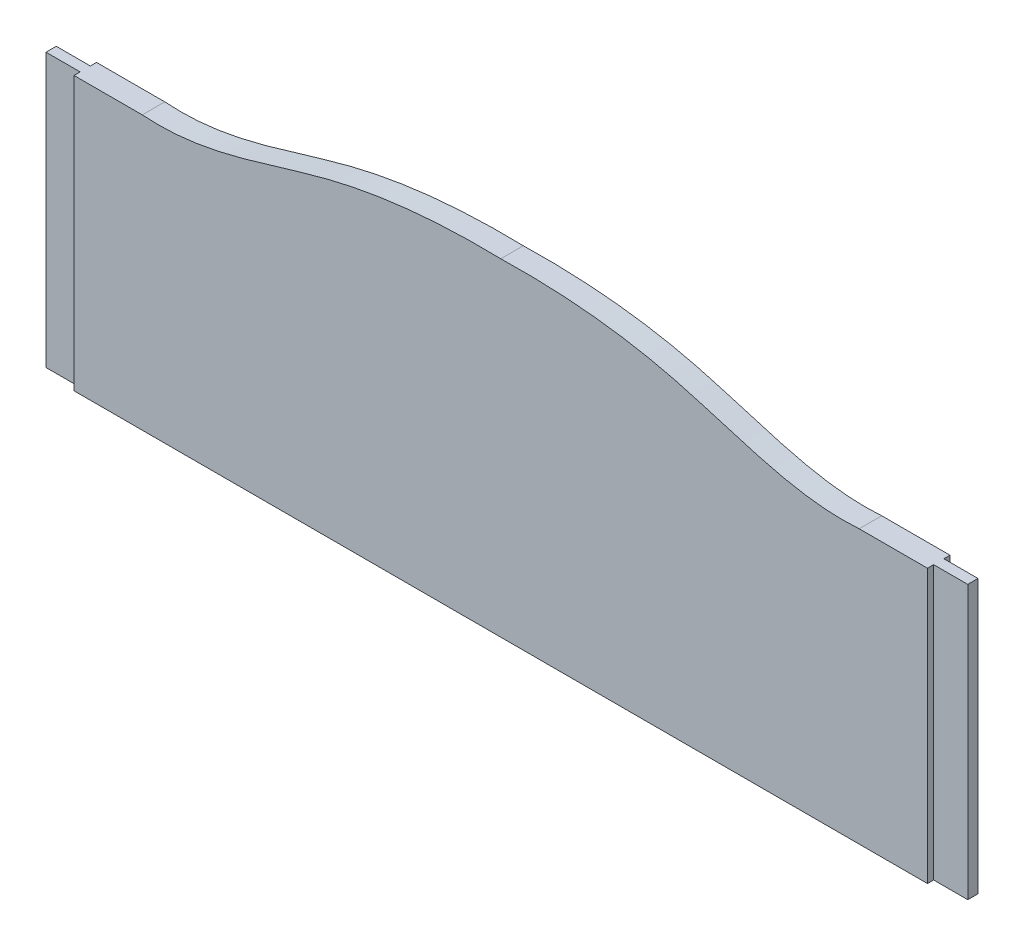
ISO-10303-21;
HEADER;
FILE_DESCRIPTION(('STEP AP214'),'2;1');
FILE_NAME('part.step','',(''),(''),'','','');
FILE_SCHEMA(('AUTOMOTIVE_DESIGN { 1 0 10303 214 1 1 1 1 }'));
ENDSEC;
DATA;
#1=APPLICATION_CONTEXT('core data for automotive mechanical design processes');
#2=APPLICATION_PROTOCOL_DEFINITION('international standard','automotive_design',2000,#1);
#3=PRODUCT_CONTEXT('',#1,'mechanical');
#4=PRODUCT('Part','Part','',(#3));
#5=PRODUCT_RELATED_PRODUCT_CATEGORY('part','',(#4));
#6=PRODUCT_DEFINITION_FORMATION('','',#4);
#7=PRODUCT_DEFINITION_CONTEXT('part definition',#1,'design');
#8=PRODUCT_DEFINITION('design','',#6,#7);
#9=PRODUCT_DEFINITION_SHAPE('','',#8);
#10=(LENGTH_UNIT() NAMED_UNIT(*) SI_UNIT(.MILLI.,.METRE.));
#11=(NAMED_UNIT(*) PLANE_ANGLE_UNIT() SI_UNIT($,.RADIAN.));
#12=(NAMED_UNIT(*) SI_UNIT($,.STERADIAN.) SOLID_ANGLE_UNIT());
#13=UNCERTAINTY_MEASURE_WITH_UNIT(LENGTH_MEASURE(1.E-05),#10,'distance_accuracy_value','');
#14=(GEOMETRIC_REPRESENTATION_CONTEXT(3) GLOBAL_UNCERTAINTY_ASSIGNED_CONTEXT((#13)) GLOBAL_UNIT_ASSIGNED_CONTEXT((#10,
#11,#12)) REPRESENTATION_CONTEXT('',''));
#15=CARTESIAN_POINT('',(0.,0.,0.));
#16=DIRECTION('',(0.,0.,1.));
#17=DIRECTION('',(1.,0.,0.));
#18=AXIS2_PLACEMENT_3D('',#15,#16,#17);
#19=CARTESIAN_POINT('',(625.,-80.0000000000001,33.));
#20=DIRECTION('',(1.,0.,0.));
#21=DIRECTION('',(0.,1.,0.));
#22=AXIS2_PLACEMENT_3D('',#19,#20,#21);
#23=PLANE('',#22);
#24=DIRECTION('',(0.,0.,-1.));
#25=VECTOR('',#24,1.);
#26=CARTESIAN_POINT('',(625.,-480.,33.));
#27=LINE('',#26,#25);
#28=CARTESIAN_POINT('',(625.,-480.,33.));
#29=VERTEX_POINT('',#28);
#30=CARTESIAN_POINT('',(625.,-480.,24.));
#31=VERTEX_POINT('',#30);
#32=EDGE_CURVE('E149',#29,#31,#27,.T.);
#33=ORIENTED_EDGE('',*,*,#32,.T.);
#34=DIRECTION('',(0.,1.,0.));
#35=VECTOR('',#34,1.);
#36=CARTESIAN_POINT('',(625.,-480.,24.));
#37=LINE('',#36,#35);
#38=CARTESIAN_POINT('',(625.,-80.0000000000001,24.));
#39=VERTEX_POINT('',#38);
#40=EDGE_CURVE('E156',#31,#39,#37,.T.);
#41=ORIENTED_EDGE('',*,*,#40,.T.);
#42=DIRECTION('',(0.,0.,-1.));
#43=VECTOR('',#42,1.);
#44=CARTESIAN_POINT('',(625.,-80.0000000000001,33.));
#45=LINE('',#44,#43);
#46=CARTESIAN_POINT('',(625.,-80.0000000000001,33.));
#47=VERTEX_POINT('',#46);
#48=EDGE_CURVE('E177',#47,#39,#45,.T.);
#49=ORIENTED_EDGE('',*,*,#48,.F.);
#50=DIRECTION('',(0.,-1.,0.));
#51=VECTOR('',#50,1.);
#52=CARTESIAN_POINT('',(625.,-80.0000000000001,33.));
#53=LINE('',#52,#51);
#54=EDGE_CURVE('E164',#47,#29,#53,.T.);
#55=ORIENTED_EDGE('',*,*,#54,.T.);
#56=EDGE_LOOP('',(#33,#41,#49,#55));
#57=FACE_BOUND('',#56,.T.);
#58=ADVANCED_FACE('F36',(#57),#23,.T.);
#59=CARTESIAN_POINT('',(-625.,-80.0000000000001,33.));
#60=DIRECTION('',(1.,0.,0.));
#61=DIRECTION('',(0.,1.,0.));
#62=AXIS2_PLACEMENT_3D('',#59,#60,#61);
#63=PLANE('',#62);
#64=DIRECTION('',(0.,1.,0.));
#65=VECTOR('',#64,1.);
#66=CARTESIAN_POINT('',(-625.,-480.,24.));
#67=LINE('',#66,#65);
#68=CARTESIAN_POINT('',(-625.,-480.,24.));
#69=VERTEX_POINT('',#68);
#70=CARTESIAN_POINT('',(-625.,-80.0000000000002,24.));
#71=VERTEX_POINT('',#70);
#72=EDGE_CURVE('E195',#69,#71,#67,.T.);
#73=ORIENTED_EDGE('',*,*,#72,.F.);
#74=DIRECTION('',(0.,0.,-1.));
#75=VECTOR('',#74,1.);
#76=CARTESIAN_POINT('',(-625.,-480.,33.));
#77=LINE('',#76,#75);
#78=CARTESIAN_POINT('',(-625.,-480.,33.));
#79=VERTEX_POINT('',#78);
#80=EDGE_CURVE('E11',#79,#69,#77,.T.);
#81=ORIENTED_EDGE('',*,*,#80,.F.);
#82=DIRECTION('',(0.,-1.,0.));
#83=VECTOR('',#82,1.);
#84=CARTESIAN_POINT('',(-625.,-80.0000000000001,33.));
#85=LINE('',#84,#83);
#86=CARTESIAN_POINT('',(-625.,-80.0000000000001,33.));
#87=VERTEX_POINT('',#86);
#88=EDGE_CURVE('E203',#87,#79,#85,.T.);
#89=ORIENTED_EDGE('',*,*,#88,.F.);
#90=DIRECTION('',(0.,0.,-1.));
#91=VECTOR('',#90,1.);
#92=CARTESIAN_POINT('',(-625.,-80.0000000000001,33.));
#93=LINE('',#92,#91);
#94=EDGE_CURVE('E331',#87,#71,#93,.T.);
#95=ORIENTED_EDGE('',*,*,#94,.T.);
#96=EDGE_LOOP('',(#73,#81,#89,#95));
#97=FACE_BOUND('',#96,.T.);
#98=ADVANCED_FACE('F230',(#97),#63,.F.);
#99=CARTESIAN_POINT('',(-625.,-480.,9.));
#100=VERTEX_POINT('',#99);
#101=CARTESIAN_POINT('',(-625.,-480.,0.));
#102=VERTEX_POINT('',#101);
#103=EDGE_CURVE('E44',#100,#102,#77,.T.);
#104=ORIENTED_EDGE('',*,*,#103,.F.);
#105=DIRECTION('',(0.,1.,0.));
#106=VECTOR('',#105,1.);
#107=CARTESIAN_POINT('',(-625.,-480.,9.));
#108=LINE('',#107,#106);
#109=CARTESIAN_POINT('',(-625.,-80.0000000000001,9.));
#110=VERTEX_POINT('',#109);
#111=EDGE_CURVE('E188',#100,#110,#108,.T.);
#112=ORIENTED_EDGE('',*,*,#111,.T.);
#113=CARTESIAN_POINT('',(-625.,-80.0000000000001,0.));
#114=VERTEX_POINT('',#113);
#115=EDGE_CURVE('E341',#110,#114,#93,.T.);
#116=ORIENTED_EDGE('',*,*,#115,.T.);
#117=DIRECTION('',(0.,-1.,0.));
#118=VECTOR('',#117,1.);
#119=CARTESIAN_POINT('',(-625.,-80.0000000000001,0.));
#120=LINE('',#119,#118);
#121=EDGE_CURVE('E197',#114,#102,#120,.T.);
#122=ORIENTED_EDGE('',*,*,#121,.T.);
#123=EDGE_LOOP('',(#104,#112,#116,#122));
#124=FACE_BOUND('',#123,.T.);
#125=ADVANCED_FACE('F38',(#124),#63,.F.);
#126=CARTESIAN_POINT('',(0.,-480.,33.));
#127=DIRECTION('',(0.,1.,0.));
#128=DIRECTION('',(-1.,0.,0.));
#129=AXIS2_PLACEMENT_3D('',#126,#127,#128);
#130=PLANE('',#129);
#131=DIRECTION('',(1.,0.,0.));
#132=VECTOR('',#131,1.);
#133=CARTESIAN_POINT('',(0.,-480.,0.));
#134=LINE('',#133,#132);
#135=CARTESIAN_POINT('',(625.,-480.,0.));
#136=VERTEX_POINT('',#135);
#137=EDGE_CURVE('E265',#102,#136,#134,.T.);
#138=ORIENTED_EDGE('',*,*,#137,.T.);
#139=CARTESIAN_POINT('',(625.,-480.,9.));
#140=VERTEX_POINT('',#139);
#141=EDGE_CURVE('E166',#140,#136,#27,.T.);
#142=ORIENTED_EDGE('',*,*,#141,.F.);
#143=DIRECTION('',(1.,0.,0.));
#144=VECTOR('',#143,1.);
#145=CARTESIAN_POINT('',(625.,-480.,9.));
#146=LINE('',#145,#144);
#147=CARTESIAN_POINT('',(675.,-480.,9.00000000000001));
#148=VERTEX_POINT('',#147);
#149=EDGE_CURVE('E161',#140,#148,#146,.T.);
#150=ORIENTED_EDGE('',*,*,#149,.T.);
#151=DIRECTION('',(0.,0.,1.));
#152=VECTOR('',#151,1.);
#153=CARTESIAN_POINT('',(675.,-480.,9.00000000000001));
#154=LINE('',#153,#152);
#155=CARTESIAN_POINT('',(675.,-480.,24.));
#156=VERTEX_POINT('',#155);
#157=EDGE_CURVE('E152',#148,#156,#154,.T.);
#158=ORIENTED_EDGE('',*,*,#157,.T.);
#159=DIRECTION('',(-1.,0.,0.));
#160=VECTOR('',#159,1.);
#161=CARTESIAN_POINT('',(625.,-480.,24.));
#162=LINE('',#161,#160);
#163=EDGE_CURVE('E145',#156,#31,#162,.T.);
#164=ORIENTED_EDGE('',*,*,#163,.T.);
#165=ORIENTED_EDGE('',*,*,#32,.F.);
#166=DIRECTION('',(1.,0.,0.));
#167=VECTOR('',#166,1.);
#168=CARTESIAN_POINT('',(0.,-480.,33.));
#169=LINE('',#168,#167);
#170=EDGE_CURVE('E206',#79,#29,#169,.T.);
#171=ORIENTED_EDGE('',*,*,#170,.F.);
#172=ORIENTED_EDGE('',*,*,#80,.T.);
#173=DIRECTION('',(1.,0.,0.));
#174=VECTOR('',#173,1.);
#175=CARTESIAN_POINT('',(-625.,-480.,24.));
#176=LINE('',#175,#174);
#177=CARTESIAN_POINT('',(-675.,-480.,24.));
#178=VERTEX_POINT('',#177);
#179=EDGE_CURVE('E186',#178,#69,#176,.T.);
#180=ORIENTED_EDGE('',*,*,#179,.F.);
#181=DIRECTION('',(0.,0.,1.));
#182=VECTOR('',#181,1.);
#183=CARTESIAN_POINT('',(-675.,-480.,9.00000000000001));
#184=LINE('',#183,#182);
#185=CARTESIAN_POINT('',(-675.,-480.,9.00000000000001));
#186=VERTEX_POINT('',#185);
#187=EDGE_CURVE('E182',#186,#178,#184,.T.);
#188=ORIENTED_EDGE('',*,*,#187,.F.);
#189=DIRECTION('',(-1.,0.,0.));
#190=VECTOR('',#189,1.);
#191=CARTESIAN_POINT('',(-625.,-480.,9.));
#192=LINE('',#191,#190);
#193=EDGE_CURVE('E179',#100,#186,#192,.T.);
#194=ORIENTED_EDGE('',*,*,#193,.F.);
#195=ORIENTED_EDGE('',*,*,#103,.T.);
#196=EDGE_LOOP('',(#138,#142,#150,#158,#164,#165,#171,#172,#180,#188,#194,#195));
#197=FACE_BOUND('',#196,.T.);
#198=ADVANCED_FACE('F147',(#197),#130,.F.);
#199=CARTESIAN_POINT('',(0.,0.,33.));
#200=CARTESIAN_POINT('',(-83.7014925767459,2.10265698343181,33.));
#201=CARTESIAN_POINT('',(-263.298331293986,-12.316995697741,33.));
#202=CARTESIAN_POINT('',(-428.044748199505,-87.2153690332924,33.));
#203=CARTESIAN_POINT('',(-525.,-80.0000000000001,33.));
#204=B_SPLINE_CURVE_WITH_KNOTS('',3,(#199,#200,#201,#202,#203),.UNSPECIFIED.,.F.,.F.,(4,1,4),
(0.,0.47219563595012,1.),.UNSPECIFIED.);
#205=DIRECTION('',(0.,0.,-1.));
#206=VECTOR('',#205,1.);
#207=SURFACE_OF_LINEAR_EXTRUSION('',#204,#206);
#208=CARTESIAN_POINT('',(0.,0.,0.));
#209=CARTESIAN_POINT('',(-83.7014925767459,2.10265698343181,0.));
#210=CARTESIAN_POINT('',(-263.298331293986,-12.316995697741,0.));
#211=CARTESIAN_POINT('',(-428.044748199505,-87.2153690332924,0.));
#212=CARTESIAN_POINT('',(-525.,-80.0000000000001,0.));
#213=B_SPLINE_CURVE_WITH_KNOTS('',3,(#208,#209,#210,#211,#212),.UNSPECIFIED.,.F.,.F.,(4,1,4),
(0.,0.47219563595012,1.),.UNSPECIFIED.);
#214=CARTESIAN_POINT('',(0.,0.,0.));
#215=VERTEX_POINT('',#214);
#216=CARTESIAN_POINT('',(-525.,-80.0000000000001,0.));
#217=VERTEX_POINT('',#216);
#218=EDGE_CURVE('E272',#215,#217,#213,.T.);
#219=ORIENTED_EDGE('',*,*,#218,.T.);
#220=DIRECTION('',(0.,0.,-1.));
#221=VECTOR('',#220,1.);
#222=CARTESIAN_POINT('',(-525.,-80.0000000000001,33.));
#223=LINE('',#222,#221);
#224=CARTESIAN_POINT('',(-525.,-80.0000000000001,33.));
#225=VERTEX_POINT('',#224);
#226=EDGE_CURVE('E344',#225,#217,#223,.T.);
#227=ORIENTED_EDGE('',*,*,#226,.F.);
#228=CARTESIAN_POINT('',(0.,0.,33.));
#229=VERTEX_POINT('',#228);
#230=EDGE_CURVE('E209',#229,#225,#204,.T.);
#231=ORIENTED_EDGE('',*,*,#230,.F.);
#232=DIRECTION('',(0.,0.,-1.));
#233=VECTOR('',#232,1.);
#234=CARTESIAN_POINT('',(0.,0.,33.));
#235=LINE('',#234,#233);
#236=EDGE_CURVE('E319',#229,#215,#235,.T.);
#237=ORIENTED_EDGE('',*,*,#236,.T.);
#238=EDGE_LOOP('',(#219,#227,#231,#237));
#239=FACE_BOUND('',#238,.T.);
#240=ADVANCED_FACE('F220',(#239),#207,.F.);
#241=CARTESIAN_POINT('',(-525.,-80.0000000000001,33.));
#242=DIRECTION('',(0.,-1.,0.));
#243=DIRECTION('',(0.,0.,-1.));
#244=AXIS2_PLACEMENT_3D('',#241,#242,#243);
#245=PLANE('',#244);
#246=DIRECTION('',(-1.,0.,0.));
#247=VECTOR('',#246,1.);
#248=CARTESIAN_POINT('',(-525.,-80.0000000000001,0.));
#249=LINE('',#248,#247);
#250=EDGE_CURVE('E207',#217,#114,#249,.T.);
#251=ORIENTED_EDGE('',*,*,#250,.T.);
#252=ORIENTED_EDGE('',*,*,#115,.F.);
#253=DIRECTION('',(-1.,0.,0.));
#254=VECTOR('',#253,1.);
#255=CARTESIAN_POINT('',(-625.,-80.0000000000002,9.));
#256=LINE('',#255,#254);
#257=CARTESIAN_POINT('',(-675.,-80.0000000000002,9.00000000000001));
#258=VERTEX_POINT('',#257);
#259=EDGE_CURVE('E59',#110,#258,#256,.T.);
#260=ORIENTED_EDGE('',*,*,#259,.T.);
#261=DIRECTION('',(0.,0.,1.));
#262=VECTOR('',#261,1.);
#263=CARTESIAN_POINT('',(-675.,-80.0000000000002,9.00000000000001));
#264=LINE('',#263,#262);
#265=CARTESIAN_POINT('',(-675.,-80.0000000000002,24.));
#266=VERTEX_POINT('',#265);
#267=EDGE_CURVE('E190',#258,#266,#264,.T.);
#268=ORIENTED_EDGE('',*,*,#267,.T.);
#269=DIRECTION('',(1.,0.,0.));
#270=VECTOR('',#269,1.);
#271=CARTESIAN_POINT('',(-625.,-80.0000000000002,24.));
#272=LINE('',#271,#270);
#273=EDGE_CURVE('E183',#266,#71,#272,.T.);
#274=ORIENTED_EDGE('',*,*,#273,.T.);
#275=ORIENTED_EDGE('',*,*,#94,.F.);
#276=DIRECTION('',(-1.,0.,0.));
#277=VECTOR('',#276,1.);
#278=CARTESIAN_POINT('',(-525.,-80.0000000000001,33.));
#279=LINE('',#278,#277);
#280=EDGE_CURVE('E214',#225,#87,#279,.T.);
#281=ORIENTED_EDGE('',*,*,#280,.F.);
#282=ORIENTED_EDGE('',*,*,#226,.T.);
#283=EDGE_LOOP('',(#251,#252,#260,#268,#274,#275,#281,#282));
#284=FACE_BOUND('',#283,.T.);
#285=ADVANCED_FACE('F223',(#284),#245,.F.);
#286=CARTESIAN_POINT('',(-264.363434754952,-28.7158493555548,33.));
#287=DIRECTION('',(0.,0.,-1.));
#288=DIRECTION('',(-1.,0.,0.));
#289=AXIS2_PLACEMENT_3D('',#286,#287,#288);
#290=PLANE('',#289);
#291=ORIENTED_EDGE('',*,*,#88,.T.);
#292=ORIENTED_EDGE('',*,*,#170,.T.);
#293=ORIENTED_EDGE('',*,*,#54,.F.);
#294=DIRECTION('',(1.,0.,0.));
#295=VECTOR('',#294,1.);
#296=CARTESIAN_POINT('',(525.,-80.0000000000001,33.));
#297=LINE('',#296,#295);
#298=CARTESIAN_POINT('',(525.,-80.0000000000001,33.));
#299=VERTEX_POINT('',#298);
#300=EDGE_CURVE('E286',#299,#47,#297,.T.);
#301=ORIENTED_EDGE('',*,*,#300,.F.);
#302=CARTESIAN_POINT('',(0.,0.,33.));
#303=CARTESIAN_POINT('',(83.7014925767459,2.10265698343181,33.));
#304=CARTESIAN_POINT('',(263.298331293986,-12.316995697741,33.));
#305=CARTESIAN_POINT('',(428.044748199505,-87.2153690332924,33.));
#306=CARTESIAN_POINT('',(525.,-80.0000000000001,33.));
#307=B_SPLINE_CURVE_WITH_KNOTS('',3,(#302,#303,#304,#305,#306),.UNSPECIFIED.,.F.,.F.,(4,1,4),
(0.,0.47219563595012,1.),.UNSPECIFIED.);
#308=EDGE_CURVE('E170',#229,#299,#307,.T.);
#309=ORIENTED_EDGE('',*,*,#308,.F.);
#310=ORIENTED_EDGE('',*,*,#230,.T.);
#311=ORIENTED_EDGE('',*,*,#280,.T.);
#312=EDGE_LOOP('',(#291,#292,#293,#301,#309,#310,#311));
#313=FACE_BOUND('',#312,.T.);
#314=ADVANCED_FACE('F323',(#313),#290,.F.);
#315=CARTESIAN_POINT('',(-264.363434754952,-28.7158493555548,0.));
#316=DIRECTION('',(0.,0.,-1.));
#317=DIRECTION('',(-1.,0.,0.));
#318=AXIS2_PLACEMENT_3D('',#315,#316,#317);
#319=PLANE('',#318);
#320=ORIENTED_EDGE('',*,*,#121,.F.);
#321=ORIENTED_EDGE('',*,*,#250,.F.);
#322=ORIENTED_EDGE('',*,*,#218,.F.);
#323=CARTESIAN_POINT('',(0.,0.,0.));
#324=CARTESIAN_POINT('',(83.7014925767459,2.10265698343181,0.));
#325=CARTESIAN_POINT('',(263.298331293986,-12.316995697741,0.));
#326=CARTESIAN_POINT('',(428.044748199505,-87.2153690332924,0.));
#327=CARTESIAN_POINT('',(525.,-80.0000000000001,0.));
#328=B_SPLINE_CURVE_WITH_KNOTS('',3,(#323,#324,#325,#326,#327),.UNSPECIFIED.,.F.,.F.,(4,1,4),
(0.,0.47219563595012,1.),.UNSPECIFIED.);
#329=CARTESIAN_POINT('',(525.,-80.0000000000001,0.));
#330=VERTEX_POINT('',#329);
#331=EDGE_CURVE('E172',#215,#330,#328,.T.);
#332=ORIENTED_EDGE('',*,*,#331,.T.);
#333=DIRECTION('',(1.,0.,0.));
#334=VECTOR('',#333,1.);
#335=CARTESIAN_POINT('',(525.,-80.0000000000001,0.));
#336=LINE('',#335,#334);
#337=CARTESIAN_POINT('',(625.,-80.0000000000001,0.));
#338=VERTEX_POINT('',#337);
#339=EDGE_CURVE('E278',#330,#338,#336,.T.);
#340=ORIENTED_EDGE('',*,*,#339,.T.);
#341=DIRECTION('',(0.,-1.,0.));
#342=VECTOR('',#341,1.);
#343=CARTESIAN_POINT('',(625.,-80.0000000000001,0.));
#344=LINE('',#343,#342);
#345=EDGE_CURVE('E260',#338,#136,#344,.T.);
#346=ORIENTED_EDGE('',*,*,#345,.T.);
#347=ORIENTED_EDGE('',*,*,#137,.F.);
#348=EDGE_LOOP('',(#320,#321,#322,#332,#340,#346,#347));
#349=FACE_BOUND('',#348,.T.);
#350=ADVANCED_FACE('F275',(#349),#319,.T.);
#351=CARTESIAN_POINT('',(-625.,-480.,24.));
#352=DIRECTION('',(0.,0.,1.));
#353=DIRECTION('',(1.,0.,0.));
#354=AXIS2_PLACEMENT_3D('',#351,#352,#353);
#355=PLANE('',#354);
#356=ORIENTED_EDGE('',*,*,#273,.F.);
#357=DIRECTION('',(0.,1.,0.));
#358=VECTOR('',#357,1.);
#359=CARTESIAN_POINT('',(-675.,-480.,24.));
#360=LINE('',#359,#358);
#361=EDGE_CURVE('E198',#178,#266,#360,.T.);
#362=ORIENTED_EDGE('',*,*,#361,.F.);
#363=ORIENTED_EDGE('',*,*,#179,.T.);
#364=ORIENTED_EDGE('',*,*,#72,.T.);
#365=EDGE_LOOP('',(#356,#362,#363,#364));
#366=FACE_BOUND('',#365,.T.);
#367=ADVANCED_FACE('F334',(#366),#355,.T.);
#368=CARTESIAN_POINT('',(-675.,-480.,9.00000000000001));
#369=DIRECTION('',(-1.,0.,0.));
#370=DIRECTION('',(0.,-1.,0.));
#371=AXIS2_PLACEMENT_3D('',#368,#369,#370);
#372=PLANE('',#371);
#373=ORIENTED_EDGE('',*,*,#267,.F.);
#374=DIRECTION('',(0.,1.,0.));
#375=VECTOR('',#374,1.);
#376=CARTESIAN_POINT('',(-675.,-480.,9.00000000000001));
#377=LINE('',#376,#375);
#378=EDGE_CURVE('E200',#186,#258,#377,.T.);
#379=ORIENTED_EDGE('',*,*,#378,.F.);
#380=ORIENTED_EDGE('',*,*,#187,.T.);
#381=ORIENTED_EDGE('',*,*,#361,.T.);
#382=EDGE_LOOP('',(#373,#379,#380,#381));
#383=FACE_BOUND('',#382,.T.);
#384=ADVANCED_FACE('F251',(#383),#372,.T.);
#385=CARTESIAN_POINT('',(-625.,-480.,9.));
#386=DIRECTION('',(0.,0.,-1.));
#387=DIRECTION('',(-1.,0.,0.));
#388=AXIS2_PLACEMENT_3D('',#385,#386,#387);
#389=PLANE('',#388);
#390=ORIENTED_EDGE('',*,*,#259,.F.);
#391=ORIENTED_EDGE('',*,*,#111,.F.);
#392=ORIENTED_EDGE('',*,*,#193,.T.);
#393=ORIENTED_EDGE('',*,*,#378,.T.);
#394=EDGE_LOOP('',(#390,#391,#392,#393));
#395=FACE_BOUND('',#394,.T.);
#396=ADVANCED_FACE('F243',(#395),#389,.T.);
#397=DIRECTION('',(0.,1.,0.));
#398=VECTOR('',#397,1.);
#399=CARTESIAN_POINT('',(625.,-480.,9.));
#400=LINE('',#399,#398);
#401=CARTESIAN_POINT('',(625.,-80.0000000000002,9.));
#402=VERTEX_POINT('',#401);
#403=EDGE_CURVE('E256',#140,#402,#400,.T.);
#404=ORIENTED_EDGE('',*,*,#403,.F.);
#405=ORIENTED_EDGE('',*,*,#141,.T.);
#406=ORIENTED_EDGE('',*,*,#345,.F.);
#407=EDGE_CURVE('E168',#402,#338,#45,.T.);
#408=ORIENTED_EDGE('',*,*,#407,.F.);
#409=EDGE_LOOP('',(#404,#405,#406,#408));
#410=FACE_BOUND('',#409,.T.);
#411=ADVANCED_FACE('F234',(#410),#23,.T.);
#412=CARTESIAN_POINT('',(525.,-80.0000000000001,33.));
#413=DIRECTION('',(0.,1.,0.));
#414=DIRECTION('',(0.,0.,1.));
#415=AXIS2_PLACEMENT_3D('',#412,#413,#414);
#416=PLANE('',#415);
#417=ORIENTED_EDGE('',*,*,#339,.F.);
#418=DIRECTION('',(0.,0.,-1.));
#419=VECTOR('',#418,1.);
#420=CARTESIAN_POINT('',(525.,-80.0000000000001,33.));
#421=LINE('',#420,#419);
#422=EDGE_CURVE('E165',#299,#330,#421,.T.);
#423=ORIENTED_EDGE('',*,*,#422,.F.);
#424=ORIENTED_EDGE('',*,*,#300,.T.);
#425=ORIENTED_EDGE('',*,*,#48,.T.);
#426=DIRECTION('',(-1.,0.,0.));
#427=VECTOR('',#426,1.);
#428=CARTESIAN_POINT('',(625.,-80.0000000000002,24.));
#429=LINE('',#428,#427);
#430=CARTESIAN_POINT('',(675.,-80.0000000000002,24.));
#431=VERTEX_POINT('',#430);
#432=EDGE_CURVE('E51',#431,#39,#429,.T.);
#433=ORIENTED_EDGE('',*,*,#432,.F.);
#434=DIRECTION('',(0.,0.,1.));
#435=VECTOR('',#434,1.);
#436=CARTESIAN_POINT('',(675.,-80.0000000000002,9.00000000000001));
#437=LINE('',#436,#435);
#438=CARTESIAN_POINT('',(675.,-80.0000000000002,9.00000000000001));
#439=VERTEX_POINT('',#438);
#440=EDGE_CURVE('E307',#439,#431,#437,.T.);
#441=ORIENTED_EDGE('',*,*,#440,.F.);
#442=DIRECTION('',(1.,0.,0.));
#443=VECTOR('',#442,1.);
#444=CARTESIAN_POINT('',(625.,-80.0000000000002,9.));
#445=LINE('',#444,#443);
#446=EDGE_CURVE('E154',#402,#439,#445,.T.);
#447=ORIENTED_EDGE('',*,*,#446,.F.);
#448=ORIENTED_EDGE('',*,*,#407,.T.);
#449=EDGE_LOOP('',(#417,#423,#424,#425,#433,#441,#447,#448));
#450=FACE_BOUND('',#449,.T.);
#451=ADVANCED_FACE('F242',(#450),#416,.T.);
#452=DIRECTION('',(0.,0.,-1.));
#453=VECTOR('',#452,1.);
#454=SURFACE_OF_LINEAR_EXTRUSION('',#307,#453);
#455=ORIENTED_EDGE('',*,*,#331,.F.);
#456=ORIENTED_EDGE('',*,*,#236,.F.);
#457=ORIENTED_EDGE('',*,*,#308,.T.);
#458=ORIENTED_EDGE('',*,*,#422,.T.);
#459=EDGE_LOOP('',(#455,#456,#457,#458));
#460=FACE_BOUND('',#459,.T.);
#461=ADVANCED_FACE('F249',(#460),#454,.T.);
#462=CARTESIAN_POINT('',(625.,-480.,9.));
#463=DIRECTION('',(0.,0.,1.));
#464=DIRECTION('',(1.,0.,0.));
#465=AXIS2_PLACEMENT_3D('',#462,#463,#464);
#466=PLANE('',#465);
#467=ORIENTED_EDGE('',*,*,#446,.T.);
#468=DIRECTION('',(0.,1.,0.));
#469=VECTOR('',#468,1.);
#470=CARTESIAN_POINT('',(675.,-480.,9.00000000000001));
#471=LINE('',#470,#469);
#472=EDGE_CURVE('E261',#148,#439,#471,.T.);
#473=ORIENTED_EDGE('',*,*,#472,.F.);
#474=ORIENTED_EDGE('',*,*,#149,.F.);
#475=ORIENTED_EDGE('',*,*,#403,.T.);
#476=EDGE_LOOP('',(#467,#473,#474,#475));
#477=FACE_BOUND('',#476,.T.);
#478=ADVANCED_FACE('F294',(#477),#466,.F.);
#479=CARTESIAN_POINT('',(675.,-480.,9.00000000000001));
#480=DIRECTION('',(-1.,0.,0.));
#481=DIRECTION('',(0.,-1.,0.));
#482=AXIS2_PLACEMENT_3D('',#479,#480,#481);
#483=PLANE('',#482);
#484=ORIENTED_EDGE('',*,*,#440,.T.);
#485=DIRECTION('',(0.,1.,0.));
#486=VECTOR('',#485,1.);
#487=CARTESIAN_POINT('',(675.,-480.,24.));
#488=LINE('',#487,#486);
#489=EDGE_CURVE('E160',#156,#431,#488,.T.);
#490=ORIENTED_EDGE('',*,*,#489,.F.);
#491=ORIENTED_EDGE('',*,*,#157,.F.);
#492=ORIENTED_EDGE('',*,*,#472,.T.);
#493=EDGE_LOOP('',(#484,#490,#491,#492));
#494=FACE_BOUND('',#493,.T.);
#495=ADVANCED_FACE('F298',(#494),#483,.F.);
#496=CARTESIAN_POINT('',(625.,-480.,24.));
#497=DIRECTION('',(0.,0.,-1.));
#498=DIRECTION('',(-1.,0.,0.));
#499=AXIS2_PLACEMENT_3D('',#496,#497,#498);
#500=PLANE('',#499);
#501=ORIENTED_EDGE('',*,*,#432,.T.);
#502=ORIENTED_EDGE('',*,*,#40,.F.);
#503=ORIENTED_EDGE('',*,*,#163,.F.);
#504=ORIENTED_EDGE('',*,*,#489,.T.);
#505=EDGE_LOOP('',(#501,#502,#503,#504));
#506=FACE_BOUND('',#505,.T.);
#507=ADVANCED_FACE('F157',(#506),#500,.F.);
#508=CLOSED_SHELL('',(#58,#98,#125,#198,#240,#285,#314,#350,#367,#384,#396,#411,#451,#461,#478,
#495,#507));
#509=MANIFOLD_SOLID_BREP('B2',#508);
#510=ADVANCED_BREP_SHAPE_REPRESENTATION('',(#18,#509),#14);
#511=SHAPE_DEFINITION_REPRESENTATION(#9,#510);
ENDSEC;
END-ISO-10303-21;
